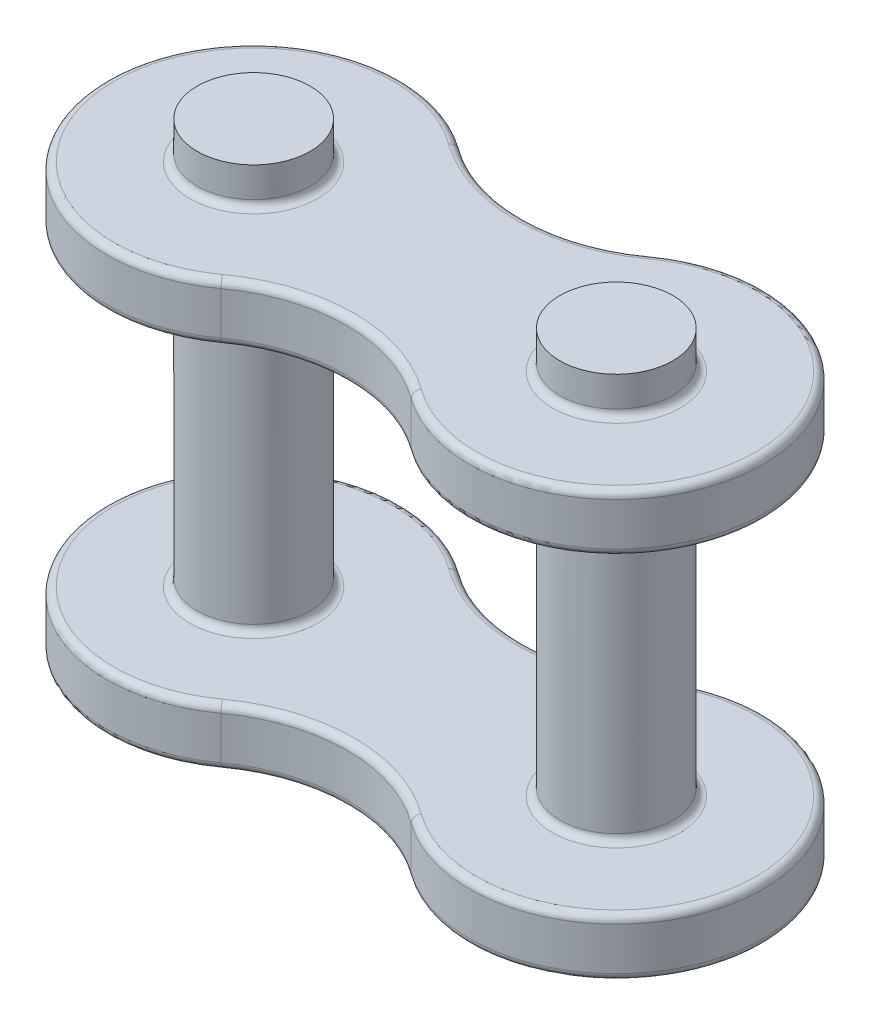
ISO-10303-21;
HEADER;
FILE_DESCRIPTION(('STEP AP214'),'2;1');
FILE_NAME('part.step','',(''),(''),'','','');
FILE_SCHEMA(('AUTOMOTIVE_DESIGN { 1 0 10303 214 1 1 1 1 }'));
ENDSEC;
DATA;
#1=APPLICATION_CONTEXT('core data for automotive mechanical design processes');
#2=APPLICATION_PROTOCOL_DEFINITION('international standard','automotive_design',2000,#1);
#3=PRODUCT_CONTEXT('',#1,'mechanical');
#4=PRODUCT('Part','Part','',(#3));
#5=PRODUCT_RELATED_PRODUCT_CATEGORY('part','',(#4));
#6=PRODUCT_DEFINITION_FORMATION('','',#4);
#7=PRODUCT_DEFINITION_CONTEXT('part definition',#1,'design');
#8=PRODUCT_DEFINITION('design','',#6,#7);
#9=PRODUCT_DEFINITION_SHAPE('','',#8);
#10=(LENGTH_UNIT() NAMED_UNIT(*) SI_UNIT(.MILLI.,.METRE.));
#11=(NAMED_UNIT(*) PLANE_ANGLE_UNIT() SI_UNIT($,.RADIAN.));
#12=(NAMED_UNIT(*) SI_UNIT($,.STERADIAN.) SOLID_ANGLE_UNIT());
#13=UNCERTAINTY_MEASURE_WITH_UNIT(LENGTH_MEASURE(1.E-05),#10,'distance_accuracy_value','');
#14=(GEOMETRIC_REPRESENTATION_CONTEXT(3) GLOBAL_UNCERTAINTY_ASSIGNED_CONTEXT((#13)) GLOBAL_UNIT_ASSIGNED_CONTEXT((#10,
#11,#12)) REPRESENTATION_CONTEXT('',''));
#15=CARTESIAN_POINT('',(0.,0.,0.));
#16=DIRECTION('',(0.,0.,1.));
#17=DIRECTION('',(1.,0.,0.));
#18=AXIS2_PLACEMENT_3D('',#15,#16,#17);
#19=CARTESIAN_POINT('',(3.175,1.0033,-4.37563141450818));
#20=DIRECTION('',(0.,1.,0.));
#21=DIRECTION('',(0.,0.,1.));
#22=AXIS2_PLACEMENT_3D('',#19,#20,#21);
#23=PLANE('',#22);
#24=CARTESIAN_POINT('',(6.35,1.0033,0.));
#25=DIRECTION('',(0.,1.,0.));
#26=DIRECTION('',(0.,0.,1.));
#27=AXIS2_PLACEMENT_3D('',#24,#25,#26);
#28=CIRCLE('',#27,2.234);
#29=CARTESIAN_POINT('',(6.35,1.0033,2.234));
#30=VERTEX_POINT('',#29);
#31=EDGE_CURVE('E243',#30,#30,#28,.F.);
#32=ORIENTED_EDGE('',*,*,#31,.T.);
#33=EDGE_LOOP('',(#32));
#34=FACE_BOUND('',#33,.T.);
#35=CARTESIAN_POINT('',(-6.35,1.0033,0.));
#36=DIRECTION('',(0.,1.,0.));
#37=DIRECTION('',(0.,0.,1.));
#38=AXIS2_PLACEMENT_3D('',#35,#36,#37);
#39=CIRCLE('',#38,2.234);
#40=CARTESIAN_POINT('',(-6.35,1.0033,2.234));
#41=VERTEX_POINT('',#40);
#42=EDGE_CURVE('E240',#41,#41,#39,.F.);
#43=ORIENTED_EDGE('',*,*,#42,.T.);
#44=EDGE_LOOP('',(#43));
#45=FACE_BOUND('',#44,.T.);
#46=CARTESIAN_POINT('',(6.35,1.0033,0.));
#47=DIRECTION('',(0.,1.,0.));
#48=DIRECTION('',(0.,0.,1.));
#49=AXIS2_PLACEMENT_3D('',#46,#47,#48);
#50=CIRCLE('',#49,4.8895);
#51=CARTESIAN_POINT('',(3.47844109205325,1.0033,3.95744357991263));
#52=VERTEX_POINT('',#51);
#53=CARTESIAN_POINT('',(3.47844109205325,1.0033,-3.95744357991263));
#54=VERTEX_POINT('',#53);
#55=EDGE_CURVE('E237',#52,#54,#50,.T.);
#56=ORIENTED_EDGE('',*,*,#55,.T.);
#57=CARTESIAN_POINT('',(0.,1.0033,-8.75126282901636));
#58=DIRECTION('',(0.,1.,0.));
#59=DIRECTION('',(0.,0.,1.));
#60=AXIS2_PLACEMENT_3D('',#57,#58,#59);
#61=CIRCLE('',#60,5.92285872058097);
#62=CARTESIAN_POINT('',(-3.47844109205325,1.0033,-3.95744357991263));
#63=VERTEX_POINT('',#62);
#64=EDGE_CURVE('E166',#54,#63,#61,.F.);
#65=ORIENTED_EDGE('',*,*,#64,.T.);
#66=CARTESIAN_POINT('',(-6.35,1.0033,0.));
#67=DIRECTION('',(0.,1.,0.));
#68=DIRECTION('',(0.,0.,1.));
#69=AXIS2_PLACEMENT_3D('',#66,#67,#68);
#70=CIRCLE('',#69,4.8895);
#71=CARTESIAN_POINT('',(-3.47844109205325,1.0033,3.95744357991263));
#72=VERTEX_POINT('',#71);
#73=EDGE_CURVE('E233',#63,#72,#70,.T.);
#74=ORIENTED_EDGE('',*,*,#73,.T.);
#75=CARTESIAN_POINT('',(0.,1.0033,8.75126282901636));
#76=DIRECTION('',(0.,1.,0.));
#77=DIRECTION('',(0.,0.,1.));
#78=AXIS2_PLACEMENT_3D('',#75,#76,#77);
#79=CIRCLE('',#78,5.92285872058097);
#80=EDGE_CURVE('E235',#72,#52,#79,.F.);
#81=ORIENTED_EDGE('',*,*,#80,.T.);
#82=EDGE_LOOP('',(#56,#65,#74,#81));
#83=FACE_BOUND('',#82,.T.);
#84=ADVANCED_FACE('F41',(#34,#45,#83),#23,.T.);
#85=CARTESIAN_POINT('',(3.175,-1.0033,-4.37563141450818));
#86=DIRECTION('',(0.,1.,0.));
#87=DIRECTION('',(0.,0.,1.));
#88=AXIS2_PLACEMENT_3D('',#85,#86,#87);
#89=PLANE('',#88);
#90=CARTESIAN_POINT('',(-6.35,-1.0033,0.));
#91=DIRECTION('',(0.,1.,0.));
#92=DIRECTION('',(0.,0.,1.));
#93=AXIS2_PLACEMENT_3D('',#90,#91,#92);
#94=CIRCLE('',#93,2.234);
#95=CARTESIAN_POINT('',(-6.35,-1.0033,2.234));
#96=VERTEX_POINT('',#95);
#97=EDGE_CURVE('E222',#96,#96,#94,.T.);
#98=ORIENTED_EDGE('',*,*,#97,.T.);
#99=EDGE_LOOP('',(#98));
#100=FACE_BOUND('',#99,.T.);
#101=CARTESIAN_POINT('',(6.35,-1.0033,0.));
#102=DIRECTION('',(0.,1.,0.));
#103=DIRECTION('',(0.,0.,1.));
#104=AXIS2_PLACEMENT_3D('',#101,#102,#103);
#105=CIRCLE('',#104,2.234);
#106=CARTESIAN_POINT('',(6.35,-1.0033,2.234));
#107=VERTEX_POINT('',#106);
#108=EDGE_CURVE('E219',#107,#107,#105,.T.);
#109=ORIENTED_EDGE('',*,*,#108,.T.);
#110=EDGE_LOOP('',(#109));
#111=FACE_BOUND('',#110,.T.);
#112=CARTESIAN_POINT('',(0.,-1.0033,-8.75126282901636));
#113=DIRECTION('',(0.,1.,0.));
#114=DIRECTION('',(0.,0.,1.));
#115=AXIS2_PLACEMENT_3D('',#112,#113,#114);
#116=CIRCLE('',#115,5.92285872058097);
#117=CARTESIAN_POINT('',(-3.47844109205325,-1.0033,-3.95744357991263));
#118=VERTEX_POINT('',#117);
#119=CARTESIAN_POINT('',(3.47844109205325,-1.0033,-3.95744357991263));
#120=VERTEX_POINT('',#119);
#121=EDGE_CURVE('E210',#118,#120,#116,.T.);
#122=ORIENTED_EDGE('',*,*,#121,.T.);
#123=CARTESIAN_POINT('',(6.35,-1.0033,0.));
#124=DIRECTION('',(0.,1.,0.));
#125=DIRECTION('',(0.,0.,1.));
#126=AXIS2_PLACEMENT_3D('',#123,#124,#125);
#127=CIRCLE('',#126,4.8895);
#128=CARTESIAN_POINT('',(3.47844109205325,-1.0033,3.95744357991263));
#129=VERTEX_POINT('',#128);
#130=EDGE_CURVE('E216',#120,#129,#127,.F.);
#131=ORIENTED_EDGE('',*,*,#130,.T.);
#132=CARTESIAN_POINT('',(0.,-1.0033,8.75126282901636));
#133=DIRECTION('',(0.,1.,0.));
#134=DIRECTION('',(0.,0.,1.));
#135=AXIS2_PLACEMENT_3D('',#132,#133,#134);
#136=CIRCLE('',#135,5.92285872058097);
#137=CARTESIAN_POINT('',(-3.47844109205325,-1.0033,3.95744357991263));
#138=VERTEX_POINT('',#137);
#139=EDGE_CURVE('E214',#129,#138,#136,.T.);
#140=ORIENTED_EDGE('',*,*,#139,.T.);
#141=CARTESIAN_POINT('',(-6.35,-1.0033,0.));
#142=DIRECTION('',(0.,1.,0.));
#143=DIRECTION('',(0.,0.,1.));
#144=AXIS2_PLACEMENT_3D('',#141,#142,#143);
#145=CIRCLE('',#144,4.8895);
#146=EDGE_CURVE('E212',#138,#118,#145,.F.);
#147=ORIENTED_EDGE('',*,*,#146,.T.);
#148=EDGE_LOOP('',(#122,#131,#140,#147));
#149=FACE_BOUND('',#148,.T.);
#150=ADVANCED_FACE('F405',(#100,#111,#149),#89,.F.);
#151=CARTESIAN_POINT('',(0.,1.0033,-8.75126282901636));
#152=DIRECTION('',(0.,-1.,0.));
#153=DIRECTION('',(0.,0.,-1.));
#154=AXIS2_PLACEMENT_3D('',#151,#152,#153);
#155=CYLINDRICAL_SURFACE('',#154,5.66885872058097);
#156=DIRECTION('',(0.,-1.,0.));
#157=VECTOR('',#156,1.);
#158=CARTESIAN_POINT('',(-3.32926920073134,1.0033,-4.16302506458341));
#159=LINE('',#158,#157);
#160=CARTESIAN_POINT('',(-3.32926920073134,0.7493,-4.16302506458341));
#161=VERTEX_POINT('',#160);
#162=CARTESIAN_POINT('',(-3.32926920073134,-0.7493,-4.16302506458341));
#163=VERTEX_POINT('',#162);
#164=EDGE_CURVE('E182',#161,#163,#159,.T.);
#165=ORIENTED_EDGE('',*,*,#164,.F.);
#166=CARTESIAN_POINT('',(0.,0.7493,-8.75126282901636));
#167=DIRECTION('',(0.,1.,0.));
#168=DIRECTION('',(0.,0.,1.));
#169=AXIS2_PLACEMENT_3D('',#166,#167,#168);
#170=CIRCLE('',#169,5.66885872058097);
#171=CARTESIAN_POINT('',(3.32926920073134,0.7493,-4.16302506458341));
#172=VERTEX_POINT('',#171);
#173=EDGE_CURVE('E163',#161,#172,#170,.T.);
#174=ORIENTED_EDGE('',*,*,#173,.T.);
#175=DIRECTION('',(0.,-1.,0.));
#176=VECTOR('',#175,1.);
#177=CARTESIAN_POINT('',(3.32926920073134,1.0033,-4.16302506458341));
#178=LINE('',#177,#176);
#179=CARTESIAN_POINT('',(3.32926920073134,-0.7493,-4.16302506458341));
#180=VERTEX_POINT('',#179);
#181=EDGE_CURVE('E188',#172,#180,#178,.T.);
#182=ORIENTED_EDGE('',*,*,#181,.T.);
#183=CARTESIAN_POINT('',(0.,-0.7493,-8.75126282901636));
#184=DIRECTION('',(0.,1.,0.));
#185=DIRECTION('',(0.,0.,1.));
#186=AXIS2_PLACEMENT_3D('',#183,#184,#185);
#187=CIRCLE('',#186,5.66885872058097);
#188=EDGE_CURVE('E191',#180,#163,#187,.F.);
#189=ORIENTED_EDGE('',*,*,#188,.T.);
#190=EDGE_LOOP('',(#165,#174,#182,#189));
#191=FACE_BOUND('',#190,.T.);
#192=ADVANCED_FACE('F187',(#191),#155,.F.);
#193=CARTESIAN_POINT('',(-6.35,1.0033,0.));
#194=DIRECTION('',(0.,-1.,0.));
#195=DIRECTION('',(0.,0.,-1.));
#196=AXIS2_PLACEMENT_3D('',#193,#194,#195);
#197=CYLINDRICAL_SURFACE('',#196,5.1435);
#198=ORIENTED_EDGE('',*,*,#164,.T.);
#199=CARTESIAN_POINT('',(-6.35,-0.7493,0.));
#200=DIRECTION('',(0.,1.,0.));
#201=DIRECTION('',(0.,0.,1.));
#202=AXIS2_PLACEMENT_3D('',#199,#200,#201);
#203=CIRCLE('',#202,5.1435);
#204=CARTESIAN_POINT('',(-3.32926920073134,-0.7493,4.16302506458341));
#205=VERTEX_POINT('',#204);
#206=EDGE_CURVE('E231',#163,#205,#203,.T.);
#207=ORIENTED_EDGE('',*,*,#206,.T.);
#208=DIRECTION('',(0.,-1.,0.));
#209=VECTOR('',#208,1.);
#210=CARTESIAN_POINT('',(-3.32926920073134,1.0033,4.16302506458341));
#211=LINE('',#210,#209);
#212=CARTESIAN_POINT('',(-3.32926920073134,0.7493,4.16302506458341));
#213=VERTEX_POINT('',#212);
#214=EDGE_CURVE('E199',#213,#205,#211,.T.);
#215=ORIENTED_EDGE('',*,*,#214,.F.);
#216=CARTESIAN_POINT('',(-6.35,0.7493,0.));
#217=DIRECTION('',(0.,1.,0.));
#218=DIRECTION('',(0.,0.,1.));
#219=AXIS2_PLACEMENT_3D('',#216,#217,#218);
#220=CIRCLE('',#219,5.1435);
#221=EDGE_CURVE('E229',#213,#161,#220,.F.);
#222=ORIENTED_EDGE('',*,*,#221,.T.);
#223=EDGE_LOOP('',(#198,#207,#215,#222));
#224=FACE_BOUND('',#223,.T.);
#225=ADVANCED_FACE('F422',(#224),#197,.T.);
#226=CARTESIAN_POINT('',(0.,1.0033,8.75126282901636));
#227=DIRECTION('',(0.,-1.,0.));
#228=DIRECTION('',(0.,0.,-1.));
#229=AXIS2_PLACEMENT_3D('',#226,#227,#228);
#230=CYLINDRICAL_SURFACE('',#229,5.66885872058097);
#231=ORIENTED_EDGE('',*,*,#214,.T.);
#232=CARTESIAN_POINT('',(0.,-0.7493,8.75126282901636));
#233=DIRECTION('',(0.,1.,0.));
#234=DIRECTION('',(0.,0.,1.));
#235=AXIS2_PLACEMENT_3D('',#232,#233,#234);
#236=CIRCLE('',#235,5.66885872058097);
#237=CARTESIAN_POINT('',(3.32926920073134,-0.7493,4.16302506458341));
#238=VERTEX_POINT('',#237);
#239=EDGE_CURVE('E227',#205,#238,#236,.F.);
#240=ORIENTED_EDGE('',*,*,#239,.T.);
#241=DIRECTION('',(0.,-1.,0.));
#242=VECTOR('',#241,1.);
#243=CARTESIAN_POINT('',(3.32926920073134,1.0033,4.16302506458341));
#244=LINE('',#243,#242);
#245=CARTESIAN_POINT('',(3.32926920073134,0.7493,4.16302506458341));
#246=VERTEX_POINT('',#245);
#247=EDGE_CURVE('E196',#246,#238,#244,.T.);
#248=ORIENTED_EDGE('',*,*,#247,.F.);
#249=CARTESIAN_POINT('',(0.,0.7493,8.75126282901636));
#250=DIRECTION('',(0.,1.,0.));
#251=DIRECTION('',(0.,0.,1.));
#252=AXIS2_PLACEMENT_3D('',#249,#250,#251);
#253=CIRCLE('',#252,5.66885872058097);
#254=EDGE_CURVE('E225',#246,#213,#253,.T.);
#255=ORIENTED_EDGE('',*,*,#254,.T.);
#256=EDGE_LOOP('',(#231,#240,#248,#255));
#257=FACE_BOUND('',#256,.T.);
#258=ADVANCED_FACE('F419',(#257),#230,.F.);
#259=CARTESIAN_POINT('',(6.35,1.0033,0.));
#260=DIRECTION('',(0.,-1.,0.));
#261=DIRECTION('',(0.,0.,-1.));
#262=AXIS2_PLACEMENT_3D('',#259,#260,#261);
#263=CYLINDRICAL_SURFACE('',#262,5.1435);
#264=ORIENTED_EDGE('',*,*,#247,.T.);
#265=CARTESIAN_POINT('',(6.35,-0.7493,0.));
#266=DIRECTION('',(0.,1.,0.));
#267=DIRECTION('',(0.,0.,1.));
#268=AXIS2_PLACEMENT_3D('',#265,#266,#267);
#269=CIRCLE('',#268,5.1435);
#270=EDGE_CURVE('E181',#238,#180,#269,.T.);
#271=ORIENTED_EDGE('',*,*,#270,.T.);
#272=ORIENTED_EDGE('',*,*,#181,.F.);
#273=CARTESIAN_POINT('',(6.35,0.7493,0.));
#274=DIRECTION('',(0.,1.,0.));
#275=DIRECTION('',(0.,0.,1.));
#276=AXIS2_PLACEMENT_3D('',#273,#274,#275);
#277=CIRCLE('',#276,5.1435);
#278=EDGE_CURVE('E173',#172,#246,#277,.F.);
#279=ORIENTED_EDGE('',*,*,#278,.T.);
#280=EDGE_LOOP('',(#264,#271,#272,#279));
#281=FACE_BOUND('',#280,.T.);
#282=ADVANCED_FACE('F194',(#281),#263,.T.);
#283=CARTESIAN_POINT('',(-6.35,-2.3114,0.));
#284=DIRECTION('',(0.,1.,0.));
#285=DIRECTION('',(0.,0.,1.));
#286=AXIS2_PLACEMENT_3D('',#283,#284,#285);
#287=PLANE('',#286);
#288=CARTESIAN_POINT('',(-6.35,-2.3114,0.));
#289=DIRECTION('',(0.,1.,0.));
#290=DIRECTION('',(0.,0.,1.));
#291=AXIS2_PLACEMENT_3D('',#288,#289,#290);
#292=CIRCLE('',#291,1.98);
#293=CARTESIAN_POINT('',(-6.35,-2.3114,1.98));
#294=VERTEX_POINT('',#293);
#295=EDGE_CURVE('E202',#294,#294,#292,.T.);
#296=ORIENTED_EDGE('',*,*,#295,.F.);
#297=EDGE_LOOP('',(#296));
#298=FACE_BOUND('',#297,.T.);
#299=ADVANCED_FACE('F418',(#298),#287,.F.);
#300=CARTESIAN_POINT('',(-6.35,15.1892,0.));
#301=DIRECTION('',(0.,-1.,0.));
#302=DIRECTION('',(0.,0.,-1.));
#303=AXIS2_PLACEMENT_3D('',#300,#301,#302);
#304=CYLINDRICAL_SURFACE('',#303,1.98);
#305=CARTESIAN_POINT('',(-6.35,-1.2573,0.));
#306=DIRECTION('',(0.,1.,0.));
#307=DIRECTION('',(0.,0.,1.));
#308=AXIS2_PLACEMENT_3D('',#305,#306,#307);
#309=CIRCLE('',#308,1.98);
#310=CARTESIAN_POINT('',(-6.35,-1.2573,1.98));
#311=VERTEX_POINT('',#310);
#312=EDGE_CURVE('E190',#311,#311,#309,.F.);
#313=ORIENTED_EDGE('',*,*,#312,.T.);
#314=EDGE_LOOP('',(#313));
#315=FACE_BOUND('',#314,.T.);
#316=ORIENTED_EDGE('',*,*,#295,.T.);
#317=EDGE_LOOP('',(#316));
#318=FACE_BOUND('',#317,.T.);
#319=ADVANCED_FACE('F399',(#315,#318),#304,.T.);
#320=CARTESIAN_POINT('',(-6.35,11.6205,0.));
#321=DIRECTION('',(0.,-1.,0.));
#322=DIRECTION('',(0.,0.,-1.));
#323=AXIS2_PLACEMENT_3D('',#320,#321,#322);
#324=CIRCLE('',#323,1.98);
#325=CARTESIAN_POINT('',(-6.35,11.6205,-1.98));
#326=VERTEX_POINT('',#325);
#327=EDGE_CURVE('E11',#326,#326,#324,.T.);
#328=ORIENTED_EDGE('',*,*,#327,.T.);
#329=EDGE_LOOP('',(#328));
#330=FACE_BOUND('',#329,.T.);
#331=CARTESIAN_POINT('',(-6.35,1.2573,0.));
#332=DIRECTION('',(0.,1.,0.));
#333=DIRECTION('',(0.,0.,1.));
#334=AXIS2_PLACEMENT_3D('',#331,#332,#333);
#335=CIRCLE('',#334,1.98);
#336=CARTESIAN_POINT('',(-6.35,1.2573,1.98));
#337=VERTEX_POINT('',#336);
#338=EDGE_CURVE('E255',#337,#337,#335,.T.);
#339=ORIENTED_EDGE('',*,*,#338,.T.);
#340=EDGE_LOOP('',(#339));
#341=FACE_BOUND('',#340,.T.);
#342=ADVANCED_FACE('F389',(#330,#341),#304,.T.);
#343=CARTESIAN_POINT('',(6.35,-2.3114,0.));
#344=DIRECTION('',(0.,-1.,0.));
#345=DIRECTION('',(0.,0.,-1.));
#346=AXIS2_PLACEMENT_3D('',#343,#344,#345);
#347=PLANE('',#346);
#348=CARTESIAN_POINT('',(6.35,-2.3114,0.));
#349=DIRECTION('',(0.,1.,0.));
#350=DIRECTION('',(0.,0.,-1.));
#351=AXIS2_PLACEMENT_3D('',#348,#349,#350);
#352=CIRCLE('',#351,1.98);
#353=CARTESIAN_POINT('',(6.35,-2.3114,-1.98));
#354=VERTEX_POINT('',#353);
#355=EDGE_CURVE('E269',#354,#354,#352,.T.);
#356=ORIENTED_EDGE('',*,*,#355,.F.);
#357=EDGE_LOOP('',(#356));
#358=FACE_BOUND('',#357,.T.);
#359=ADVANCED_FACE('F387',(#358),#347,.T.);
#360=CARTESIAN_POINT('',(6.35,15.1892,0.));
#361=DIRECTION('',(0.,-1.,0.));
#362=DIRECTION('',(0.,0.,-1.));
#363=AXIS2_PLACEMENT_3D('',#360,#361,#362);
#364=CYLINDRICAL_SURFACE('',#363,1.98);
#365=CARTESIAN_POINT('',(6.35,-1.2573,0.));
#366=DIRECTION('',(0.,1.,0.));
#367=DIRECTION('',(0.,0.,1.));
#368=AXIS2_PLACEMENT_3D('',#365,#366,#367);
#369=CIRCLE('',#368,1.98);
#370=CARTESIAN_POINT('',(6.35,-1.2573,1.98));
#371=VERTEX_POINT('',#370);
#372=EDGE_CURVE('E249',#371,#371,#369,.F.);
#373=ORIENTED_EDGE('',*,*,#372,.T.);
#374=EDGE_LOOP('',(#373));
#375=FACE_BOUND('',#374,.T.);
#376=ORIENTED_EDGE('',*,*,#355,.T.);
#377=EDGE_LOOP('',(#376));
#378=FACE_BOUND('',#377,.T.);
#379=ADVANCED_FACE('F385',(#375,#378),#364,.T.);
#380=CARTESIAN_POINT('',(6.35,11.6205,0.));
#381=DIRECTION('',(0.,-1.,0.));
#382=DIRECTION('',(0.,0.,-1.));
#383=AXIS2_PLACEMENT_3D('',#380,#381,#382);
#384=CIRCLE('',#383,1.98);
#385=CARTESIAN_POINT('',(6.35,11.6205,-1.98));
#386=VERTEX_POINT('',#385);
#387=EDGE_CURVE('E50',#386,#386,#384,.T.);
#388=ORIENTED_EDGE('',*,*,#387,.T.);
#389=EDGE_LOOP('',(#388));
#390=FACE_BOUND('',#389,.T.);
#391=CARTESIAN_POINT('',(6.35,1.2573,0.));
#392=DIRECTION('',(0.,1.,0.));
#393=DIRECTION('',(0.,0.,1.));
#394=AXIS2_PLACEMENT_3D('',#391,#392,#393);
#395=CIRCLE('',#394,1.98);
#396=CARTESIAN_POINT('',(6.35,1.2573,1.98));
#397=VERTEX_POINT('',#396);
#398=EDGE_CURVE('E252',#397,#397,#395,.T.);
#399=ORIENTED_EDGE('',*,*,#398,.T.);
#400=EDGE_LOOP('',(#399));
#401=FACE_BOUND('',#400,.T.);
#402=ADVANCED_FACE('F395',(#390,#401),#364,.T.);
#403=CARTESIAN_POINT('',(-6.35,-0.7493,0.));
#404=DIRECTION('',(0.,1.,0.));
#405=DIRECTION('',(0.,0.,1.));
#406=AXIS2_PLACEMENT_3D('',#403,#404,#405);
#407=TOROIDAL_SURFACE('',#406,4.8895,0.254);
#408=CARTESIAN_POINT('',(-3.47844109205325,-0.7493,-3.95744357991263));
#409=DIRECTION('',(0.809375923900732,0.,0.587290910716177));
#410=DIRECTION('',(0.587290910716177,0.,-0.809375923900732));
#411=AXIS2_PLACEMENT_3D('',#408,#409,#410);
#412=CIRCLE('',#411,0.254);
#413=EDGE_CURVE('E263',#118,#163,#412,.T.);
#414=ORIENTED_EDGE('',*,*,#413,.F.);
#415=ORIENTED_EDGE('',*,*,#146,.F.);
#416=CARTESIAN_POINT('',(-3.47844109205325,-0.7493,3.95744357991263));
#417=DIRECTION('',(0.809375923900732,0.,-0.587290910716177));
#418=DIRECTION('',(-0.587290910716177,0.,-0.809375923900732));
#419=AXIS2_PLACEMENT_3D('',#416,#417,#418);
#420=CIRCLE('',#419,0.254);
#421=EDGE_CURVE('E266',#205,#138,#420,.T.);
#422=ORIENTED_EDGE('',*,*,#421,.F.);
#423=ORIENTED_EDGE('',*,*,#206,.F.);
#424=EDGE_LOOP('',(#414,#415,#422,#423));
#425=FACE_BOUND('',#424,.T.);
#426=ADVANCED_FACE('F441',(#425),#407,.T.);
#427=CARTESIAN_POINT('',(0.,-0.7493,8.75126282901636));
#428=DIRECTION('',(0.,1.,0.));
#429=DIRECTION('',(0.,0.,1.));
#430=AXIS2_PLACEMENT_3D('',#427,#428,#429);
#431=TOROIDAL_SURFACE('',#430,5.92285872058097,0.254);
#432=ORIENTED_EDGE('',*,*,#421,.T.);
#433=ORIENTED_EDGE('',*,*,#139,.F.);
#434=CARTESIAN_POINT('',(3.47844109205325,-0.7493,3.95744357991263));
#435=DIRECTION('',(0.809375923900732,0.,0.587290910716177));
#436=DIRECTION('',(0.587290910716177,0.,-0.809375923900732));
#437=AXIS2_PLACEMENT_3D('',#434,#435,#436);
#438=CIRCLE('',#437,0.254);
#439=EDGE_CURVE('E261',#238,#129,#438,.T.);
#440=ORIENTED_EDGE('',*,*,#439,.F.);
#441=ORIENTED_EDGE('',*,*,#239,.F.);
#442=EDGE_LOOP('',(#432,#433,#440,#441));
#443=FACE_BOUND('',#442,.T.);
#444=ADVANCED_FACE('F437',(#443),#431,.T.);
#445=CARTESIAN_POINT('',(0.,-0.7493,-8.75126282901636));
#446=DIRECTION('',(0.,1.,0.));
#447=DIRECTION('',(0.,0.,1.));
#448=AXIS2_PLACEMENT_3D('',#445,#446,#447);
#449=TOROIDAL_SURFACE('',#448,5.92285872058097,0.254);
#450=ORIENTED_EDGE('',*,*,#413,.T.);
#451=ORIENTED_EDGE('',*,*,#188,.F.);
#452=CARTESIAN_POINT('',(3.47844109205325,-0.7493,-3.95744357991263));
#453=DIRECTION('',(0.809375923900732,0.,-0.587290910716177));
#454=DIRECTION('',(-0.587290910716177,0.,-0.809375923900732));
#455=AXIS2_PLACEMENT_3D('',#452,#453,#454);
#456=CIRCLE('',#455,0.254);
#457=EDGE_CURVE('E259',#120,#180,#456,.T.);
#458=ORIENTED_EDGE('',*,*,#457,.F.);
#459=ORIENTED_EDGE('',*,*,#121,.F.);
#460=EDGE_LOOP('',(#450,#451,#458,#459));
#461=FACE_BOUND('',#460,.T.);
#462=ADVANCED_FACE('F433',(#461),#449,.T.);
#463=CARTESIAN_POINT('',(6.35,-0.7493,0.));
#464=DIRECTION('',(0.,1.,0.));
#465=DIRECTION('',(0.,0.,1.));
#466=AXIS2_PLACEMENT_3D('',#463,#464,#465);
#467=TOROIDAL_SURFACE('',#466,4.8895,0.254);
#468=ORIENTED_EDGE('',*,*,#439,.T.);
#469=ORIENTED_EDGE('',*,*,#130,.F.);
#470=ORIENTED_EDGE('',*,*,#457,.T.);
#471=ORIENTED_EDGE('',*,*,#270,.F.);
#472=EDGE_LOOP('',(#468,#469,#470,#471));
#473=FACE_BOUND('',#472,.T.);
#474=ADVANCED_FACE('F429',(#473),#467,.T.);
#475=CARTESIAN_POINT('',(0.,0.7493,8.75126282901636));
#476=DIRECTION('',(0.,1.,0.));
#477=DIRECTION('',(0.,0.,1.));
#478=AXIS2_PLACEMENT_3D('',#475,#476,#477);
#479=TOROIDAL_SURFACE('',#478,5.92285872058097,0.254);
#480=CARTESIAN_POINT('',(-3.47844109205325,0.7493,3.95744357991263));
#481=DIRECTION('',(-0.809375923900732,0.,0.587290910716177));
#482=DIRECTION('',(0.587290910716177,0.,0.809375923900732));
#483=AXIS2_PLACEMENT_3D('',#480,#481,#482);
#484=CIRCLE('',#483,0.254);
#485=EDGE_CURVE('E169',#213,#72,#484,.T.);
#486=ORIENTED_EDGE('',*,*,#485,.F.);
#487=ORIENTED_EDGE('',*,*,#254,.F.);
#488=CARTESIAN_POINT('',(3.47844109205325,0.7493,3.95744357991263));
#489=DIRECTION('',(0.809375923900732,0.,0.587290910716177));
#490=DIRECTION('',(0.587290910716177,0.,-0.809375923900732));
#491=AXIS2_PLACEMENT_3D('',#488,#489,#490);
#492=CIRCLE('',#491,0.254);
#493=EDGE_CURVE('E176',#52,#246,#492,.T.);
#494=ORIENTED_EDGE('',*,*,#493,.F.);
#495=ORIENTED_EDGE('',*,*,#80,.F.);
#496=EDGE_LOOP('',(#486,#487,#494,#495));
#497=FACE_BOUND('',#496,.T.);
#498=ADVANCED_FACE('F432',(#497),#479,.T.);
#499=CARTESIAN_POINT('',(6.35,0.7493,0.));
#500=DIRECTION('',(0.,1.,0.));
#501=DIRECTION('',(0.,0.,1.));
#502=AXIS2_PLACEMENT_3D('',#499,#500,#501);
#503=TOROIDAL_SURFACE('',#502,4.8895,0.254);
#504=ORIENTED_EDGE('',*,*,#493,.T.);
#505=ORIENTED_EDGE('',*,*,#278,.F.);
#506=CARTESIAN_POINT('',(3.47844109205325,0.7493,-3.95744357991263));
#507=DIRECTION('',(-0.809375923900731,0.,0.587290910716178));
#508=DIRECTION('',(0.587290910716178,0.,0.809375923900731));
#509=AXIS2_PLACEMENT_3D('',#506,#507,#508);
#510=CIRCLE('',#509,0.254);
#511=EDGE_CURVE('E159',#54,#172,#510,.T.);
#512=ORIENTED_EDGE('',*,*,#511,.F.);
#513=ORIENTED_EDGE('',*,*,#55,.F.);
#514=EDGE_LOOP('',(#504,#505,#512,#513));
#515=FACE_BOUND('',#514,.T.);
#516=ADVANCED_FACE('F174',(#515),#503,.T.);
#517=CARTESIAN_POINT('',(-6.35,0.7493,0.));
#518=DIRECTION('',(0.,1.,0.));
#519=DIRECTION('',(0.,0.,1.));
#520=AXIS2_PLACEMENT_3D('',#517,#518,#519);
#521=TOROIDAL_SURFACE('',#520,4.8895,0.254);
#522=ORIENTED_EDGE('',*,*,#485,.T.);
#523=ORIENTED_EDGE('',*,*,#73,.F.);
#524=CARTESIAN_POINT('',(-3.47844109205325,0.7493,-3.95744357991263));
#525=DIRECTION('',(0.809375923900732,0.,0.587290910716177));
#526=DIRECTION('',(0.587290910716177,0.,-0.809375923900732));
#527=AXIS2_PLACEMENT_3D('',#524,#525,#526);
#528=CIRCLE('',#527,0.254);
#529=EDGE_CURVE('E170',#161,#63,#528,.T.);
#530=ORIENTED_EDGE('',*,*,#529,.F.);
#531=ORIENTED_EDGE('',*,*,#221,.F.);
#532=EDGE_LOOP('',(#522,#523,#530,#531));
#533=FACE_BOUND('',#532,.T.);
#534=ADVANCED_FACE('F449',(#533),#521,.T.);
#535=CARTESIAN_POINT('',(0.,0.7493,-8.75126282901636));
#536=DIRECTION('',(0.,1.,0.));
#537=DIRECTION('',(0.,0.,1.));
#538=AXIS2_PLACEMENT_3D('',#535,#536,#537);
#539=TOROIDAL_SURFACE('',#538,5.92285872058097,0.254);
#540=ORIENTED_EDGE('',*,*,#511,.T.);
#541=ORIENTED_EDGE('',*,*,#173,.F.);
#542=ORIENTED_EDGE('',*,*,#529,.T.);
#543=ORIENTED_EDGE('',*,*,#64,.F.);
#544=EDGE_LOOP('',(#540,#541,#542,#543));
#545=FACE_BOUND('',#544,.T.);
#546=ADVANCED_FACE('F161',(#545),#539,.T.);
#547=CARTESIAN_POINT('',(-6.35,-1.2573,0.));
#548=DIRECTION('',(0.,1.,0.));
#549=DIRECTION('',(0.,0.,1.));
#550=AXIS2_PLACEMENT_3D('',#547,#548,#549);
#551=TOROIDAL_SURFACE('',#550,2.234,0.254);
#552=ORIENTED_EDGE('',*,*,#97,.F.);
#553=EDGE_LOOP('',(#552));
#554=FACE_BOUND('',#553,.T.);
#555=ORIENTED_EDGE('',*,*,#312,.F.);
#556=EDGE_LOOP('',(#555));
#557=FACE_BOUND('',#556,.T.);
#558=ADVANCED_FACE('F448',(#554,#557),#551,.F.);
#559=CARTESIAN_POINT('',(6.35,-1.2573,0.));
#560=DIRECTION('',(0.,1.,0.));
#561=DIRECTION('',(0.,0.,1.));
#562=AXIS2_PLACEMENT_3D('',#559,#560,#561);
#563=TOROIDAL_SURFACE('',#562,2.234,0.254);
#564=ORIENTED_EDGE('',*,*,#108,.F.);
#565=EDGE_LOOP('',(#564));
#566=FACE_BOUND('',#565,.T.);
#567=ORIENTED_EDGE('',*,*,#372,.F.);
#568=EDGE_LOOP('',(#567));
#569=FACE_BOUND('',#568,.T.);
#570=ADVANCED_FACE('F460',(#566,#569),#563,.F.);
#571=CARTESIAN_POINT('',(6.35,1.2573,0.));
#572=DIRECTION('',(0.,1.,0.));
#573=DIRECTION('',(0.,0.,1.));
#574=AXIS2_PLACEMENT_3D('',#571,#572,#573);
#575=TOROIDAL_SURFACE('',#574,2.234,0.254);
#576=ORIENTED_EDGE('',*,*,#31,.F.);
#577=EDGE_LOOP('',(#576));
#578=FACE_BOUND('',#577,.T.);
#579=ORIENTED_EDGE('',*,*,#398,.F.);
#580=EDGE_LOOP('',(#579));
#581=FACE_BOUND('',#580,.T.);
#582=ADVANCED_FACE('F464',(#578,#581),#575,.F.);
#583=CARTESIAN_POINT('',(-6.35,1.2573,0.));
#584=DIRECTION('',(0.,1.,0.));
#585=DIRECTION('',(0.,0.,1.));
#586=AXIS2_PLACEMENT_3D('',#583,#584,#585);
#587=TOROIDAL_SURFACE('',#586,2.234,0.254);
#588=ORIENTED_EDGE('',*,*,#42,.F.);
#589=EDGE_LOOP('',(#588));
#590=FACE_BOUND('',#589,.T.);
#591=ORIENTED_EDGE('',*,*,#338,.F.);
#592=EDGE_LOOP('',(#591));
#593=FACE_BOUND('',#592,.T.);
#594=ADVANCED_FACE('F468',(#590,#593),#587,.F.);
#595=CARTESIAN_POINT('',(0.,11.8745,-8.75126282901636));
#596=DIRECTION('',(0.,1.,0.));
#597=DIRECTION('',(0.,0.,1.));
#598=AXIS2_PLACEMENT_3D('',#595,#596,#597);
#599=CYLINDRICAL_SURFACE('',#598,5.66885872058097);
#600=DIRECTION('',(0.,1.,0.));
#601=VECTOR('',#600,1.);
#602=CARTESIAN_POINT('',(3.32926920073134,11.8745,-4.16302506458341));
#603=LINE('',#602,#601);
#604=CARTESIAN_POINT('',(3.32926920073134,12.1285,-4.16302506458341));
#605=VERTEX_POINT('',#604);
#606=CARTESIAN_POINT('',(3.32926920073134,13.6271,-4.16302506458341));
#607=VERTEX_POINT('',#606);
#608=EDGE_CURVE('E270',#605,#607,#603,.T.);
#609=ORIENTED_EDGE('',*,*,#608,.F.);
#610=CARTESIAN_POINT('',(0.,12.1285,-8.75126282901636));
#611=DIRECTION('',(0.,-1.,0.));
#612=DIRECTION('',(0.,0.,-1.));
#613=AXIS2_PLACEMENT_3D('',#610,#611,#612);
#614=CIRCLE('',#613,5.66885872058097);
#615=CARTESIAN_POINT('',(-3.32926920073134,12.1285,-4.16302506458341));
#616=VERTEX_POINT('',#615);
#617=EDGE_CURVE('E304',#605,#616,#614,.T.);
#618=ORIENTED_EDGE('',*,*,#617,.T.);
#619=DIRECTION('',(0.,1.,0.));
#620=VECTOR('',#619,1.);
#621=CARTESIAN_POINT('',(-3.32926920073134,11.8745,-4.16302506458341));
#622=LINE('',#621,#620);
#623=CARTESIAN_POINT('',(-3.32926920073134,13.6271,-4.16302506458341));
#624=VERTEX_POINT('',#623);
#625=EDGE_CURVE('E338',#616,#624,#622,.T.);
#626=ORIENTED_EDGE('',*,*,#625,.T.);
#627=CARTESIAN_POINT('',(0.,13.6271,-8.75126282901636));
#628=DIRECTION('',(0.,-1.,0.));
#629=DIRECTION('',(0.,0.,-1.));
#630=AXIS2_PLACEMENT_3D('',#627,#628,#629);
#631=CIRCLE('',#630,5.66885872058097);
#632=EDGE_CURVE('E302',#624,#607,#631,.F.);
#633=ORIENTED_EDGE('',*,*,#632,.T.);
#634=EDGE_LOOP('',(#609,#618,#626,#633));
#635=FACE_BOUND('',#634,.T.);
#636=ADVANCED_FACE('F366',(#635),#599,.F.);
#637=CARTESIAN_POINT('',(6.35,11.8745,0.));
#638=DIRECTION('',(0.,1.,0.));
#639=DIRECTION('',(0.,0.,1.));
#640=AXIS2_PLACEMENT_3D('',#637,#638,#639);
#641=CYLINDRICAL_SURFACE('',#640,5.1435);
#642=ORIENTED_EDGE('',*,*,#608,.T.);
#643=CARTESIAN_POINT('',(6.35,13.6271,0.));
#644=DIRECTION('',(0.,-1.,0.));
#645=DIRECTION('',(0.,0.,-1.));
#646=AXIS2_PLACEMENT_3D('',#643,#644,#645);
#647=CIRCLE('',#646,5.1435);
#648=CARTESIAN_POINT('',(3.32926920073134,13.6271,4.16302506458341));
#649=VERTEX_POINT('',#648);
#650=EDGE_CURVE('E291',#607,#649,#647,.T.);
#651=ORIENTED_EDGE('',*,*,#650,.T.);
#652=DIRECTION('',(0.,1.,0.));
#653=VECTOR('',#652,1.);
#654=CARTESIAN_POINT('',(3.32926920073134,11.8745,4.16302506458341));
#655=LINE('',#654,#653);
#656=CARTESIAN_POINT('',(3.32926920073134,12.1285,4.16302506458341));
#657=VERTEX_POINT('',#656);
#658=EDGE_CURVE('E373',#657,#649,#655,.T.);
#659=ORIENTED_EDGE('',*,*,#658,.F.);
#660=CARTESIAN_POINT('',(6.35,12.1285,0.));
#661=DIRECTION('',(0.,-1.,0.));
#662=DIRECTION('',(0.,0.,-1.));
#663=AXIS2_PLACEMENT_3D('',#660,#661,#662);
#664=CIRCLE('',#663,5.1435);
#665=EDGE_CURVE('E289',#657,#605,#664,.F.);
#666=ORIENTED_EDGE('',*,*,#665,.T.);
#667=EDGE_LOOP('',(#642,#651,#659,#666));
#668=FACE_BOUND('',#667,.T.);
#669=ADVANCED_FACE('F533',(#668),#641,.T.);
#670=CARTESIAN_POINT('',(0.,11.8745,8.75126282901636));
#671=DIRECTION('',(0.,1.,0.));
#672=DIRECTION('',(0.,0.,1.));
#673=AXIS2_PLACEMENT_3D('',#670,#671,#672);
#674=CYLINDRICAL_SURFACE('',#673,5.66885872058097);
#675=ORIENTED_EDGE('',*,*,#658,.T.);
#676=CARTESIAN_POINT('',(0.,13.6271,8.75126282901636));
#677=DIRECTION('',(0.,-1.,0.));
#678=DIRECTION('',(0.,0.,-1.));
#679=AXIS2_PLACEMENT_3D('',#676,#677,#678);
#680=CIRCLE('',#679,5.66885872058097);
#681=CARTESIAN_POINT('',(-3.32926920073134,13.6271,4.16302506458341));
#682=VERTEX_POINT('',#681);
#683=EDGE_CURVE('E296',#649,#682,#680,.F.);
#684=ORIENTED_EDGE('',*,*,#683,.T.);
#685=DIRECTION('',(0.,1.,0.));
#686=VECTOR('',#685,1.);
#687=CARTESIAN_POINT('',(-3.32926920073134,11.8745,4.16302506458341));
#688=LINE('',#687,#686);
#689=CARTESIAN_POINT('',(-3.32926920073134,12.1285,4.16302506458341));
#690=VERTEX_POINT('',#689);
#691=EDGE_CURVE('E371',#690,#682,#688,.T.);
#692=ORIENTED_EDGE('',*,*,#691,.F.);
#693=CARTESIAN_POINT('',(0.,12.1285,8.75126282901636));
#694=DIRECTION('',(0.,-1.,0.));
#695=DIRECTION('',(0.,0.,-1.));
#696=AXIS2_PLACEMENT_3D('',#693,#694,#695);
#697=CIRCLE('',#696,5.66885872058097);
#698=EDGE_CURVE('E294',#690,#657,#697,.T.);
#699=ORIENTED_EDGE('',*,*,#698,.T.);
#700=EDGE_LOOP('',(#675,#684,#692,#699));
#701=FACE_BOUND('',#700,.T.);
#702=ADVANCED_FACE('F528',(#701),#674,.F.);
#703=CARTESIAN_POINT('',(-6.35,11.8745,0.));
#704=DIRECTION('',(0.,1.,0.));
#705=DIRECTION('',(0.,0.,1.));
#706=AXIS2_PLACEMENT_3D('',#703,#704,#705);
#707=CYLINDRICAL_SURFACE('',#706,5.1435);
#708=ORIENTED_EDGE('',*,*,#691,.T.);
#709=CARTESIAN_POINT('',(-6.35,13.6271,0.));
#710=DIRECTION('',(0.,-1.,0.));
#711=DIRECTION('',(0.,0.,-1.));
#712=AXIS2_PLACEMENT_3D('',#709,#710,#711);
#713=CIRCLE('',#712,5.1435);
#714=EDGE_CURVE('E300',#682,#624,#713,.T.);
#715=ORIENTED_EDGE('',*,*,#714,.T.);
#716=ORIENTED_EDGE('',*,*,#625,.F.);
#717=CARTESIAN_POINT('',(-6.35,12.1285,0.));
#718=DIRECTION('',(0.,-1.,0.));
#719=DIRECTION('',(0.,0.,-1.));
#720=AXIS2_PLACEMENT_3D('',#717,#718,#719);
#721=CIRCLE('',#720,5.1435);
#722=EDGE_CURVE('E298',#616,#690,#721,.F.);
#723=ORIENTED_EDGE('',*,*,#722,.T.);
#724=EDGE_LOOP('',(#708,#715,#716,#723));
#725=FACE_BOUND('',#724,.T.);
#726=ADVANCED_FACE('F369',(#725),#707,.T.);
#727=CARTESIAN_POINT('',(3.175,11.8745,-4.37563141450818));
#728=DIRECTION('',(0.,-1.,0.));
#729=DIRECTION('',(0.,0.,1.));
#730=AXIS2_PLACEMENT_3D('',#727,#728,#729);
#731=PLANE('',#730);
#732=CARTESIAN_POINT('',(6.35,11.8745,0.));
#733=DIRECTION('',(0.,-1.,0.));
#734=DIRECTION('',(0.,0.,-1.));
#735=AXIS2_PLACEMENT_3D('',#732,#733,#734);
#736=CIRCLE('',#735,2.234);
#737=CARTESIAN_POINT('',(6.35,11.8745,-2.234));
#738=VERTEX_POINT('',#737);
#739=EDGE_CURVE('E317',#738,#738,#736,.F.);
#740=ORIENTED_EDGE('',*,*,#739,.T.);
#741=EDGE_LOOP('',(#740));
#742=FACE_BOUND('',#741,.T.);
#743=CARTESIAN_POINT('',(-6.35,11.8745,0.));
#744=DIRECTION('',(0.,-1.,0.));
#745=DIRECTION('',(0.,0.,-1.));
#746=AXIS2_PLACEMENT_3D('',#743,#744,#745);
#747=CIRCLE('',#746,2.234);
#748=CARTESIAN_POINT('',(-6.35,11.8745,-2.234));
#749=VERTEX_POINT('',#748);
#750=EDGE_CURVE('E314',#749,#749,#747,.F.);
#751=ORIENTED_EDGE('',*,*,#750,.T.);
#752=EDGE_LOOP('',(#751));
#753=FACE_BOUND('',#752,.T.);
#754=CARTESIAN_POINT('',(-6.35,11.8745,0.));
#755=DIRECTION('',(0.,-1.,0.));
#756=DIRECTION('',(0.,0.,-1.));
#757=AXIS2_PLACEMENT_3D('',#754,#755,#756);
#758=CIRCLE('',#757,4.8895);
#759=CARTESIAN_POINT('',(-3.47844109205325,11.8745,3.95744357991263));
#760=VERTEX_POINT('',#759);
#761=CARTESIAN_POINT('',(-3.47844109205325,11.8745,-3.95744357991263));
#762=VERTEX_POINT('',#761);
#763=EDGE_CURVE('E307',#760,#762,#758,.T.);
#764=ORIENTED_EDGE('',*,*,#763,.T.);
#765=CARTESIAN_POINT('',(0.,11.8745,-8.75126282901636));
#766=DIRECTION('',(0.,-1.,0.));
#767=DIRECTION('',(0.,0.,-1.));
#768=AXIS2_PLACEMENT_3D('',#765,#766,#767);
#769=CIRCLE('',#768,5.92285872058097);
#770=CARTESIAN_POINT('',(3.47844109205325,11.8745,-3.95744357991263));
#771=VERTEX_POINT('',#770);
#772=EDGE_CURVE('E312',#762,#771,#769,.F.);
#773=ORIENTED_EDGE('',*,*,#772,.T.);
#774=CARTESIAN_POINT('',(6.35,11.8745,0.));
#775=DIRECTION('',(0.,-1.,0.));
#776=DIRECTION('',(0.,0.,-1.));
#777=AXIS2_PLACEMENT_3D('',#774,#775,#776);
#778=CIRCLE('',#777,4.8895);
#779=CARTESIAN_POINT('',(3.47844109205325,11.8745,3.95744357991263));
#780=VERTEX_POINT('',#779);
#781=EDGE_CURVE('E65',#771,#780,#778,.T.);
#782=ORIENTED_EDGE('',*,*,#781,.T.);
#783=CARTESIAN_POINT('',(0.,11.8745,8.75126282901636));
#784=DIRECTION('',(0.,-1.,0.));
#785=DIRECTION('',(0.,0.,-1.));
#786=AXIS2_PLACEMENT_3D('',#783,#784,#785);
#787=CIRCLE('',#786,5.92285872058097);
#788=EDGE_CURVE('E309',#780,#760,#787,.F.);
#789=ORIENTED_EDGE('',*,*,#788,.T.);
#790=EDGE_LOOP('',(#764,#773,#782,#789));
#791=FACE_BOUND('',#790,.T.);
#792=ADVANCED_FACE('F355',(#742,#753,#791),#731,.T.);
#793=CARTESIAN_POINT('',(3.175,13.8811,-4.37563141450818));
#794=DIRECTION('',(0.,-1.,0.));
#795=DIRECTION('',(0.,0.,1.));
#796=AXIS2_PLACEMENT_3D('',#793,#794,#795);
#797=PLANE('',#796);
#798=CARTESIAN_POINT('',(-6.35,13.8811,0.));
#799=DIRECTION('',(0.,-1.,0.));
#800=DIRECTION('',(0.,0.,-1.));
#801=AXIS2_PLACEMENT_3D('',#798,#799,#800);
#802=CIRCLE('',#801,2.234);
#803=CARTESIAN_POINT('',(-6.35,13.8811,-2.234));
#804=VERTEX_POINT('',#803);
#805=EDGE_CURVE('E286',#804,#804,#802,.T.);
#806=ORIENTED_EDGE('',*,*,#805,.T.);
#807=EDGE_LOOP('',(#806));
#808=FACE_BOUND('',#807,.T.);
#809=CARTESIAN_POINT('',(6.35,13.8811,0.));
#810=DIRECTION('',(0.,-1.,0.));
#811=DIRECTION('',(0.,0.,-1.));
#812=AXIS2_PLACEMENT_3D('',#809,#810,#811);
#813=CIRCLE('',#812,2.234);
#814=CARTESIAN_POINT('',(6.35,13.8811,-2.234));
#815=VERTEX_POINT('',#814);
#816=EDGE_CURVE('E283',#815,#815,#813,.T.);
#817=ORIENTED_EDGE('',*,*,#816,.T.);
#818=EDGE_LOOP('',(#817));
#819=FACE_BOUND('',#818,.T.);
#820=CARTESIAN_POINT('',(0.,13.8811,8.75126282901636));
#821=DIRECTION('',(0.,-1.,0.));
#822=DIRECTION('',(0.,0.,-1.));
#823=AXIS2_PLACEMENT_3D('',#820,#821,#822);
#824=CIRCLE('',#823,5.92285872058097);
#825=CARTESIAN_POINT('',(-3.47844109205325,13.8811,3.95744357991263));
#826=VERTEX_POINT('',#825);
#827=CARTESIAN_POINT('',(3.47844109205325,13.8811,3.95744357991263));
#828=VERTEX_POINT('',#827);
#829=EDGE_CURVE('E278',#826,#828,#824,.T.);
#830=ORIENTED_EDGE('',*,*,#829,.T.);
#831=CARTESIAN_POINT('',(6.35,13.8811,0.));
#832=DIRECTION('',(0.,-1.,0.));
#833=DIRECTION('',(0.,0.,-1.));
#834=AXIS2_PLACEMENT_3D('',#831,#832,#833);
#835=CIRCLE('',#834,4.8895);
#836=CARTESIAN_POINT('',(3.47844109205325,13.8811,-3.95744357991263));
#837=VERTEX_POINT('',#836);
#838=EDGE_CURVE('E280',#828,#837,#835,.F.);
#839=ORIENTED_EDGE('',*,*,#838,.T.);
#840=CARTESIAN_POINT('',(0.,13.8811,-8.75126282901636));
#841=DIRECTION('',(0.,-1.,0.));
#842=DIRECTION('',(0.,0.,-1.));
#843=AXIS2_PLACEMENT_3D('',#840,#841,#842);
#844=CIRCLE('',#843,5.92285872058097);
#845=CARTESIAN_POINT('',(-3.47844109205325,13.8811,-3.95744357991263));
#846=VERTEX_POINT('',#845);
#847=EDGE_CURVE('E258',#837,#846,#844,.T.);
#848=ORIENTED_EDGE('',*,*,#847,.T.);
#849=CARTESIAN_POINT('',(-6.35,13.8811,0.));
#850=DIRECTION('',(0.,-1.,0.));
#851=DIRECTION('',(0.,0.,-1.));
#852=AXIS2_PLACEMENT_3D('',#849,#850,#851);
#853=CIRCLE('',#852,4.8895);
#854=EDGE_CURVE('E276',#846,#826,#853,.F.);
#855=ORIENTED_EDGE('',*,*,#854,.T.);
#856=EDGE_LOOP('',(#830,#839,#848,#855));
#857=FACE_BOUND('',#856,.T.);
#858=ADVANCED_FACE('F517',(#808,#819,#857),#797,.F.);
#859=CARTESIAN_POINT('',(6.35,15.1892,0.));
#860=DIRECTION('',(0.,-1.,0.));
#861=DIRECTION('',(0.,0.,-1.));
#862=AXIS2_PLACEMENT_3D('',#859,#860,#861);
#863=PLANE('',#862);
#864=CARTESIAN_POINT('',(6.35,15.1892,0.));
#865=DIRECTION('',(0.,1.,0.));
#866=DIRECTION('',(0.,0.,-1.));
#867=AXIS2_PLACEMENT_3D('',#864,#865,#866);
#868=CIRCLE('',#867,1.98);
#869=CARTESIAN_POINT('',(6.35,15.1892,-1.98));
#870=VERTEX_POINT('',#869);
#871=EDGE_CURVE('E379',#870,#870,#868,.T.);
#872=ORIENTED_EDGE('',*,*,#871,.T.);
#873=EDGE_LOOP('',(#872));
#874=FACE_BOUND('',#873,.T.);
#875=ADVANCED_FACE('F525',(#874),#863,.F.);
#876=CARTESIAN_POINT('',(6.35,14.1351,0.));
#877=DIRECTION('',(0.,-1.,0.));
#878=DIRECTION('',(0.,0.,-1.));
#879=AXIS2_PLACEMENT_3D('',#876,#877,#878);
#880=CIRCLE('',#879,1.98);
#881=CARTESIAN_POINT('',(6.35,14.1351,-1.98));
#882=VERTEX_POINT('',#881);
#883=EDGE_CURVE('E323',#882,#882,#880,.F.);
#884=ORIENTED_EDGE('',*,*,#883,.T.);
#885=EDGE_LOOP('',(#884));
#886=FACE_BOUND('',#885,.T.);
#887=ORIENTED_EDGE('',*,*,#871,.F.);
#888=EDGE_LOOP('',(#887));
#889=FACE_BOUND('',#888,.T.);
#890=ADVANCED_FACE('F398',(#886,#889),#364,.T.);
#891=CARTESIAN_POINT('',(-6.35,15.1892,0.));
#892=DIRECTION('',(0.,1.,0.));
#893=DIRECTION('',(0.,0.,1.));
#894=AXIS2_PLACEMENT_3D('',#891,#892,#893);
#895=PLANE('',#894);
#896=CARTESIAN_POINT('',(-6.35,15.1892,0.));
#897=DIRECTION('',(0.,1.,0.));
#898=DIRECTION('',(0.,0.,1.));
#899=AXIS2_PLACEMENT_3D('',#896,#897,#898);
#900=CIRCLE('',#899,1.98);
#901=CARTESIAN_POINT('',(-6.35,15.1892,1.98));
#902=VERTEX_POINT('',#901);
#903=EDGE_CURVE('E197',#902,#902,#900,.T.);
#904=ORIENTED_EDGE('',*,*,#903,.T.);
#905=EDGE_LOOP('',(#904));
#906=FACE_BOUND('',#905,.T.);
#907=ADVANCED_FACE('F544',(#906),#895,.T.);
#908=CARTESIAN_POINT('',(-6.35,14.1351,0.));
#909=DIRECTION('',(0.,-1.,0.));
#910=DIRECTION('',(0.,0.,-1.));
#911=AXIS2_PLACEMENT_3D('',#908,#909,#910);
#912=CIRCLE('',#911,1.98);
#913=CARTESIAN_POINT('',(-6.35,14.1351,-1.98));
#914=VERTEX_POINT('',#913);
#915=EDGE_CURVE('E320',#914,#914,#912,.F.);
#916=ORIENTED_EDGE('',*,*,#915,.T.);
#917=EDGE_LOOP('',(#916));
#918=FACE_BOUND('',#917,.T.);
#919=ORIENTED_EDGE('',*,*,#903,.F.);
#920=EDGE_LOOP('',(#919));
#921=FACE_BOUND('',#920,.T.);
#922=ADVANCED_FACE('F402',(#918,#921),#304,.T.);
#923=CARTESIAN_POINT('',(-6.35,13.6271,0.));
#924=DIRECTION('',(0.,-1.,0.));
#925=DIRECTION('',(0.,0.,-1.));
#926=AXIS2_PLACEMENT_3D('',#923,#924,#925);
#927=TOROIDAL_SURFACE('',#926,4.8895,0.254);
#928=CARTESIAN_POINT('',(-3.47844109205325,13.6271,-3.95744357991263));
#929=DIRECTION('',(0.809375923900732,0.,0.587290910716177));
#930=DIRECTION('',(0.587290910716177,0.,-0.809375923900732));
#931=AXIS2_PLACEMENT_3D('',#928,#929,#930);
#932=CIRCLE('',#931,0.254);
#933=EDGE_CURVE('E332',#624,#846,#932,.T.);
#934=ORIENTED_EDGE('',*,*,#933,.F.);
#935=ORIENTED_EDGE('',*,*,#714,.F.);
#936=CARTESIAN_POINT('',(-3.47844109205325,13.6271,3.95744357991263));
#937=DIRECTION('',(0.809375923900732,0.,-0.587290910716177));
#938=DIRECTION('',(-0.587290910716177,0.,-0.809375923900732));
#939=AXIS2_PLACEMENT_3D('',#936,#937,#938);
#940=CIRCLE('',#939,0.254);
#941=EDGE_CURVE('E335',#826,#682,#940,.T.);
#942=ORIENTED_EDGE('',*,*,#941,.F.);
#943=ORIENTED_EDGE('',*,*,#854,.F.);
#944=EDGE_LOOP('',(#934,#935,#942,#943));
#945=FACE_BOUND('',#944,.T.);
#946=ADVANCED_FACE('F484',(#945),#927,.T.);
#947=CARTESIAN_POINT('',(0.,13.6271,8.75126282901636));
#948=DIRECTION('',(0.,-1.,0.));
#949=DIRECTION('',(0.,0.,-1.));
#950=AXIS2_PLACEMENT_3D('',#947,#948,#949);
#951=TOROIDAL_SURFACE('',#950,5.92285872058097,0.254);
#952=ORIENTED_EDGE('',*,*,#941,.T.);
#953=ORIENTED_EDGE('',*,*,#683,.F.);
#954=CARTESIAN_POINT('',(3.47844109205325,13.6271,3.95744357991263));
#955=DIRECTION('',(0.809375923900732,0.,0.587290910716177));
#956=DIRECTION('',(0.587290910716177,0.,-0.809375923900732));
#957=AXIS2_PLACEMENT_3D('',#954,#955,#956);
#958=CIRCLE('',#957,0.254);
#959=EDGE_CURVE('E330',#828,#649,#958,.T.);
#960=ORIENTED_EDGE('',*,*,#959,.F.);
#961=ORIENTED_EDGE('',*,*,#829,.F.);
#962=EDGE_LOOP('',(#952,#953,#960,#961));
#963=FACE_BOUND('',#962,.T.);
#964=ADVANCED_FACE('F480',(#963),#951,.T.);
#965=CARTESIAN_POINT('',(0.,13.6271,-8.75126282901636));
#966=DIRECTION('',(0.,-1.,0.));
#967=DIRECTION('',(0.,0.,-1.));
#968=AXIS2_PLACEMENT_3D('',#965,#966,#967);
#969=TOROIDAL_SURFACE('',#968,5.92285872058097,0.254);
#970=ORIENTED_EDGE('',*,*,#933,.T.);
#971=ORIENTED_EDGE('',*,*,#847,.F.);
#972=CARTESIAN_POINT('',(3.47844109205325,13.6271,-3.95744357991263));
#973=DIRECTION('',(0.809375923900732,0.,-0.587290910716177));
#974=DIRECTION('',(-0.587290910716177,0.,-0.809375923900732));
#975=AXIS2_PLACEMENT_3D('',#972,#973,#974);
#976=CIRCLE('',#975,0.254);
#977=EDGE_CURVE('E328',#607,#837,#976,.T.);
#978=ORIENTED_EDGE('',*,*,#977,.F.);
#979=ORIENTED_EDGE('',*,*,#632,.F.);
#980=EDGE_LOOP('',(#970,#971,#978,#979));
#981=FACE_BOUND('',#980,.T.);
#982=ADVANCED_FACE('F476',(#981),#969,.T.);
#983=CARTESIAN_POINT('',(6.35,13.6271,0.));
#984=DIRECTION('',(0.,-1.,0.));
#985=DIRECTION('',(0.,0.,-1.));
#986=AXIS2_PLACEMENT_3D('',#983,#984,#985);
#987=TOROIDAL_SURFACE('',#986,4.8895,0.254);
#988=ORIENTED_EDGE('',*,*,#959,.T.);
#989=ORIENTED_EDGE('',*,*,#650,.F.);
#990=ORIENTED_EDGE('',*,*,#977,.T.);
#991=ORIENTED_EDGE('',*,*,#838,.F.);
#992=EDGE_LOOP('',(#988,#989,#990,#991));
#993=FACE_BOUND('',#992,.T.);
#994=ADVANCED_FACE('F473',(#993),#987,.T.);
#995=CARTESIAN_POINT('',(0.,12.1285,8.75126282901636));
#996=DIRECTION('',(0.,-1.,0.));
#997=DIRECTION('',(0.,0.,-1.));
#998=AXIS2_PLACEMENT_3D('',#995,#996,#997);
#999=TOROIDAL_SURFACE('',#998,5.92285872058097,0.254);
#1000=CARTESIAN_POINT('',(-3.47844109205325,12.1285,3.95744357991263));
#1001=DIRECTION('',(-0.809375923900732,0.,0.587290910716177));
#1002=DIRECTION('',(0.587290910716177,0.,0.809375923900732));
#1003=AXIS2_PLACEMENT_3D('',#1000,#1001,#1002);
#1004=CIRCLE('',#1003,0.254);
#1005=EDGE_CURVE('E341',#760,#690,#1004,.T.);
#1006=ORIENTED_EDGE('',*,*,#1005,.F.);
#1007=ORIENTED_EDGE('',*,*,#788,.F.);
#1008=CARTESIAN_POINT('',(3.47844109205325,12.1285,3.95744357991263));
#1009=DIRECTION('',(0.809375923900732,0.,0.587290910716177));
#1010=DIRECTION('',(0.587290910716177,0.,-0.809375923900732));
#1011=AXIS2_PLACEMENT_3D('',#1008,#1009,#1010);
#1012=CIRCLE('',#1011,0.254);
#1013=EDGE_CURVE('E45',#657,#780,#1012,.T.);
#1014=ORIENTED_EDGE('',*,*,#1013,.F.);
#1015=ORIENTED_EDGE('',*,*,#698,.F.);
#1016=EDGE_LOOP('',(#1006,#1007,#1014,#1015));
#1017=FACE_BOUND('',#1016,.T.);
#1018=ADVANCED_FACE('F354',(#1017),#999,.T.);
#1019=CARTESIAN_POINT('',(6.35,12.1285,0.));
#1020=DIRECTION('',(0.,-1.,0.));
#1021=DIRECTION('',(0.,0.,-1.));
#1022=AXIS2_PLACEMENT_3D('',#1019,#1020,#1021);
#1023=TOROIDAL_SURFACE('',#1022,4.8895,0.254);
#1024=ORIENTED_EDGE('',*,*,#1013,.T.);
#1025=ORIENTED_EDGE('',*,*,#781,.F.);
#1026=CARTESIAN_POINT('',(3.47844109205325,12.1285,-3.95744357991263));
#1027=DIRECTION('',(-0.809375923900732,0.,0.587290910716177));
#1028=DIRECTION('',(0.587290910716177,0.,0.809375923900732));
#1029=AXIS2_PLACEMENT_3D('',#1026,#1027,#1028);
#1030=CIRCLE('',#1029,0.254);
#1031=EDGE_CURVE('E58',#605,#771,#1030,.T.);
#1032=ORIENTED_EDGE('',*,*,#1031,.F.);
#1033=ORIENTED_EDGE('',*,*,#665,.F.);
#1034=EDGE_LOOP('',(#1024,#1025,#1032,#1033));
#1035=FACE_BOUND('',#1034,.T.);
#1036=ADVANCED_FACE('F351',(#1035),#1023,.T.);
#1037=CARTESIAN_POINT('',(-6.35,12.1285,0.));
#1038=DIRECTION('',(0.,-1.,0.));
#1039=DIRECTION('',(0.,0.,-1.));
#1040=AXIS2_PLACEMENT_3D('',#1037,#1038,#1039);
#1041=TOROIDAL_SURFACE('',#1040,4.8895,0.254);
#1042=ORIENTED_EDGE('',*,*,#1005,.T.);
#1043=ORIENTED_EDGE('',*,*,#722,.F.);
#1044=CARTESIAN_POINT('',(-3.47844109205325,12.1285,-3.95744357991263));
#1045=DIRECTION('',(0.809375923900733,0.,0.587290910716175));
#1046=DIRECTION('',(0.587290910716175,0.,-0.809375923900734));
#1047=AXIS2_PLACEMENT_3D('',#1044,#1045,#1046);
#1048=CIRCLE('',#1047,0.254);
#1049=EDGE_CURVE('E339',#762,#616,#1048,.T.);
#1050=ORIENTED_EDGE('',*,*,#1049,.F.);
#1051=ORIENTED_EDGE('',*,*,#763,.F.);
#1052=EDGE_LOOP('',(#1042,#1043,#1050,#1051));
#1053=FACE_BOUND('',#1052,.T.);
#1054=ADVANCED_FACE('F358',(#1053),#1041,.T.);
#1055=CARTESIAN_POINT('',(0.,12.1285,-8.75126282901636));
#1056=DIRECTION('',(0.,-1.,0.));
#1057=DIRECTION('',(0.,0.,-1.));
#1058=AXIS2_PLACEMENT_3D('',#1055,#1056,#1057);
#1059=TOROIDAL_SURFACE('',#1058,5.92285872058097,0.254);
#1060=ORIENTED_EDGE('',*,*,#1031,.T.);
#1061=ORIENTED_EDGE('',*,*,#772,.F.);
#1062=ORIENTED_EDGE('',*,*,#1049,.T.);
#1063=ORIENTED_EDGE('',*,*,#617,.F.);
#1064=EDGE_LOOP('',(#1060,#1061,#1062,#1063));
#1065=FACE_BOUND('',#1064,.T.);
#1066=ADVANCED_FACE('F357',(#1065),#1059,.T.);
#1067=CARTESIAN_POINT('',(-6.35,14.1351,0.));
#1068=DIRECTION('',(0.,-1.,0.));
#1069=DIRECTION('',(0.,0.,-1.));
#1070=AXIS2_PLACEMENT_3D('',#1067,#1068,#1069);
#1071=TOROIDAL_SURFACE('',#1070,2.234,0.254);
#1072=ORIENTED_EDGE('',*,*,#915,.F.);
#1073=EDGE_LOOP('',(#1072));
#1074=FACE_BOUND('',#1073,.T.);
#1075=ORIENTED_EDGE('',*,*,#805,.F.);
#1076=EDGE_LOOP('',(#1075));
#1077=FACE_BOUND('',#1076,.T.);
#1078=ADVANCED_FACE('F491',(#1074,#1077),#1071,.F.);
#1079=CARTESIAN_POINT('',(6.35,14.1351,0.));
#1080=DIRECTION('',(0.,-1.,0.));
#1081=DIRECTION('',(0.,0.,-1.));
#1082=AXIS2_PLACEMENT_3D('',#1079,#1080,#1081);
#1083=TOROIDAL_SURFACE('',#1082,2.234,0.254);
#1084=ORIENTED_EDGE('',*,*,#883,.F.);
#1085=EDGE_LOOP('',(#1084));
#1086=FACE_BOUND('',#1085,.T.);
#1087=ORIENTED_EDGE('',*,*,#816,.F.);
#1088=EDGE_LOOP('',(#1087));
#1089=FACE_BOUND('',#1088,.T.);
#1090=ADVANCED_FACE('F500',(#1086,#1089),#1083,.F.);
#1091=CARTESIAN_POINT('',(6.35,11.6205,0.));
#1092=DIRECTION('',(0.,-1.,0.));
#1093=DIRECTION('',(0.,0.,-1.));
#1094=AXIS2_PLACEMENT_3D('',#1091,#1092,#1093);
#1095=TOROIDAL_SURFACE('',#1094,2.234,0.254);
#1096=ORIENTED_EDGE('',*,*,#387,.F.);
#1097=EDGE_LOOP('',(#1096));
#1098=FACE_BOUND('',#1097,.T.);
#1099=ORIENTED_EDGE('',*,*,#739,.F.);
#1100=EDGE_LOOP('',(#1099));
#1101=FACE_BOUND('',#1100,.T.);
#1102=ADVANCED_FACE('F503',(#1098,#1101),#1095,.F.);
#1103=CARTESIAN_POINT('',(-6.35,11.6205,0.));
#1104=DIRECTION('',(0.,-1.,0.));
#1105=DIRECTION('',(0.,0.,-1.));
#1106=AXIS2_PLACEMENT_3D('',#1103,#1104,#1105);
#1107=TOROIDAL_SURFACE('',#1106,2.234,0.254);
#1108=ORIENTED_EDGE('',*,*,#327,.F.);
#1109=EDGE_LOOP('',(#1108));
#1110=FACE_BOUND('',#1109,.T.);
#1111=ORIENTED_EDGE('',*,*,#750,.F.);
#1112=EDGE_LOOP('',(#1111));
#1113=FACE_BOUND('',#1112,.T.);
#1114=ADVANCED_FACE('F43',(#1110,#1113),#1107,.F.);
#1115=CLOSED_SHELL('',(#84,#150,#192,#225,#258,#282,#299,#319,#342,#359,#379,#402,#426,#444,
#462,#474,#498,#516,#534,#546,#558,#570,#582,#594,#636,#669,#702,#726,#792,#858,#875,#890,#907,
#922,#946,#964,#982,#994,#1018,#1036,#1054,#1066,#1078,#1090,#1102,#1114));
#1116=MANIFOLD_SOLID_BREP('B2',#1115);
#1117=ADVANCED_BREP_SHAPE_REPRESENTATION('',(#18,#1116),#14);
#1118=SHAPE_DEFINITION_REPRESENTATION(#9,#1117);
ENDSEC;
END-ISO-10303-21;
